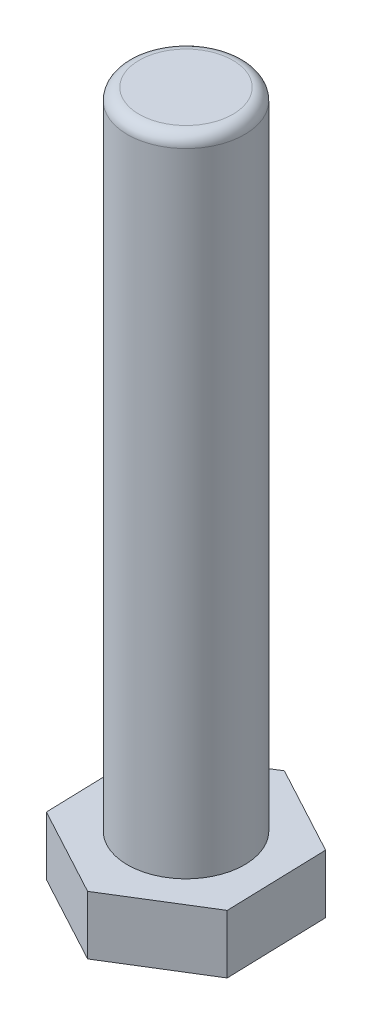
ISO-10303-21;
HEADER;
FILE_DESCRIPTION(('STEP AP214'),'2;1');
FILE_NAME('part.step','',(''),(''),'','','');
FILE_SCHEMA(('AUTOMOTIVE_DESIGN { 1 0 10303 214 1 1 1 1 }'));
ENDSEC;
DATA;
#1=APPLICATION_CONTEXT('core data for automotive mechanical design processes');
#2=APPLICATION_PROTOCOL_DEFINITION('international standard','automotive_design',2000,#1);
#3=PRODUCT_CONTEXT('',#1,'mechanical');
#4=PRODUCT('Part','Part','',(#3));
#5=PRODUCT_RELATED_PRODUCT_CATEGORY('part','',(#4));
#6=PRODUCT_DEFINITION_FORMATION('','',#4);
#7=PRODUCT_DEFINITION_CONTEXT('part definition',#1,'design');
#8=PRODUCT_DEFINITION('design','',#6,#7);
#9=PRODUCT_DEFINITION_SHAPE('','',#8);
#10=(LENGTH_UNIT() NAMED_UNIT(*) SI_UNIT(.MILLI.,.METRE.));
#11=(NAMED_UNIT(*) PLANE_ANGLE_UNIT() SI_UNIT($,.RADIAN.));
#12=(NAMED_UNIT(*) SI_UNIT($,.STERADIAN.) SOLID_ANGLE_UNIT());
#13=UNCERTAINTY_MEASURE_WITH_UNIT(LENGTH_MEASURE(1.E-05),#10,'distance_accuracy_value','');
#14=(GEOMETRIC_REPRESENTATION_CONTEXT(3) GLOBAL_UNCERTAINTY_ASSIGNED_CONTEXT((#13)) GLOBAL_UNIT_ASSIGNED_CONTEXT((#10,
#11,#12)) REPRESENTATION_CONTEXT('',''));
#15=CARTESIAN_POINT('',(0.,0.,0.));
#16=DIRECTION('',(0.,0.,1.));
#17=DIRECTION('',(1.,0.,0.));
#18=AXIS2_PLACEMENT_3D('',#15,#16,#17);
#19=CARTESIAN_POINT('',(-15.2505200028496,10.,-8.21106811825871));
#20=DIRECTION('',(0.99955911956303,0.,-0.0296911855334134));
#21=DIRECTION('',(-0.0296911855334134,0.,-0.999559119563031));
#22=AXIS2_PLACEMENT_3D('',#19,#20,#21);
#23=PLANE('',#22);
#24=DIRECTION('',(0.0296911855334134,0.,0.99955911956303));
#25=VECTOR('',#24,1.);
#26=CARTESIAN_POINT('',(-15.2505200028496,0.,-8.21106811825871));
#27=LINE('',#26,#25);
#28=CARTESIAN_POINT('',(-15.2505200028496,0.,-8.21106811825871));
#29=VERTEX_POINT('',#28);
#30=CARTESIAN_POINT('',(-14.7362535840413,0.,9.10180368426112));
#31=VERTEX_POINT('',#30);
#32=EDGE_CURVE('E123',#29,#31,#27,.T.);
#33=ORIENTED_EDGE('',*,*,#32,.T.);
#34=DIRECTION('',(0.,-1.,0.));
#35=VECTOR('',#34,1.);
#36=CARTESIAN_POINT('',(-14.7362535840413,10.,9.10180368426112));
#37=LINE('',#36,#35);
#38=CARTESIAN_POINT('',(-14.7362535840413,10.,9.10180368426112));
#39=VERTEX_POINT('',#38);
#40=EDGE_CURVE('E140',#39,#31,#37,.T.);
#41=ORIENTED_EDGE('',*,*,#40,.F.);
#42=DIRECTION('',(0.0296911855334134,0.,0.99955911956303));
#43=VECTOR('',#42,1.);
#44=CARTESIAN_POINT('',(-15.2505200028496,10.,-8.21106811825871));
#45=LINE('',#44,#43);
#46=CARTESIAN_POINT('',(-15.2505200028496,10.,-8.21106811825871));
#47=VERTEX_POINT('',#46);
#48=EDGE_CURVE('E133',#47,#39,#45,.T.);
#49=ORIENTED_EDGE('',*,*,#48,.F.);
#50=DIRECTION('',(0.,-1.,0.));
#51=VECTOR('',#50,1.);
#52=CARTESIAN_POINT('',(-15.2505200028496,10.,-8.21106811825871));
#53=LINE('',#52,#51);
#54=EDGE_CURVE('E119',#47,#29,#53,.T.);
#55=ORIENTED_EDGE('',*,*,#54,.T.);
#56=EDGE_LOOP('',(#33,#41,#49,#55));
#57=FACE_BOUND('',#56,.T.);
#58=ADVANCED_FACE('F37',(#57),#23,.F.);
#59=CARTESIAN_POINT('',(-14.7362535840413,10.,9.10180368426112));
#60=DIRECTION('',(0.474066238841102,0.,-0.880489182892698));
#61=DIRECTION('',(-0.880489182892698,0.,-0.474066238841102));
#62=AXIS2_PLACEMENT_3D('',#59,#60,#61);
#63=PLANE('',#62);
#64=DIRECTION('',(0.880489182892698,0.,0.474066238841102));
#65=VECTOR('',#64,1.);
#66=CARTESIAN_POINT('',(-14.7362535840413,0.,9.10180368426112));
#67=LINE('',#66,#65);
#68=CARTESIAN_POINT('',(0.51426641880826,0.,17.3128718025198));
#69=VERTEX_POINT('',#68);
#70=EDGE_CURVE('E126',#31,#69,#67,.T.);
#71=ORIENTED_EDGE('',*,*,#70,.T.);
#72=DIRECTION('',(0.,-1.,0.));
#73=VECTOR('',#72,1.);
#74=CARTESIAN_POINT('',(0.51426641880826,10.,17.3128718025198));
#75=LINE('',#74,#73);
#76=CARTESIAN_POINT('',(0.51426641880826,10.,17.3128718025198));
#77=VERTEX_POINT('',#76);
#78=EDGE_CURVE('E137',#77,#69,#75,.T.);
#79=ORIENTED_EDGE('',*,*,#78,.F.);
#80=DIRECTION('',(0.880489182892698,0.,0.474066238841102));
#81=VECTOR('',#80,1.);
#82=CARTESIAN_POINT('',(-14.7362535840413,10.,9.10180368426112));
#83=LINE('',#82,#81);
#84=EDGE_CURVE('E92',#39,#77,#83,.T.);
#85=ORIENTED_EDGE('',*,*,#84,.F.);
#86=ORIENTED_EDGE('',*,*,#40,.T.);
#87=EDGE_LOOP('',(#71,#79,#85,#86));
#88=FACE_BOUND('',#87,.T.);
#89=ADVANCED_FACE('F153',(#88),#63,.F.);
#90=CARTESIAN_POINT('',(0.51426641880826,10.,17.3128718025198));
#91=DIRECTION('',(-0.525492880721928,0.,-0.850797997359285));
#92=DIRECTION('',(-0.850797997359285,0.,0.525492880721928));
#93=AXIS2_PLACEMENT_3D('',#90,#91,#92);
#94=PLANE('',#93);
#95=DIRECTION('',(0.850797997359284,0.,-0.525492880721928));
#96=VECTOR('',#95,1.);
#97=CARTESIAN_POINT('',(0.51426641880826,0.,17.3128718025198));
#98=LINE('',#97,#96);
#99=CARTESIAN_POINT('',(15.2505200028496,0.,8.21106811825871));
#100=VERTEX_POINT('',#99);
#101=EDGE_CURVE('E128',#69,#100,#98,.T.);
#102=ORIENTED_EDGE('',*,*,#101,.T.);
#103=DIRECTION('',(0.,-1.,0.));
#104=VECTOR('',#103,1.);
#105=CARTESIAN_POINT('',(15.2505200028496,10.,8.21106811825871));
#106=LINE('',#105,#104);
#107=CARTESIAN_POINT('',(15.2505200028496,10.,8.21106811825871));
#108=VERTEX_POINT('',#107);
#109=EDGE_CURVE('E114',#108,#100,#106,.T.);
#110=ORIENTED_EDGE('',*,*,#109,.F.);
#111=DIRECTION('',(0.850797997359284,0.,-0.525492880721928));
#112=VECTOR('',#111,1.);
#113=CARTESIAN_POINT('',(0.51426641880826,10.,17.3128718025198));
#114=LINE('',#113,#112);
#115=EDGE_CURVE('E105',#77,#108,#114,.T.);
#116=ORIENTED_EDGE('',*,*,#115,.F.);
#117=ORIENTED_EDGE('',*,*,#78,.T.);
#118=EDGE_LOOP('',(#102,#110,#116,#117));
#119=FACE_BOUND('',#118,.T.);
#120=ADVANCED_FACE('F156',(#119),#94,.F.);
#121=CARTESIAN_POINT('',(15.2505200028496,10.,8.21106811825871));
#122=DIRECTION('',(-0.99955911956303,0.,0.0296911855334137));
#123=DIRECTION('',(0.0296911855334137,0.,0.999559119563031));
#124=AXIS2_PLACEMENT_3D('',#121,#122,#123);
#125=PLANE('',#124);
#126=DIRECTION('',(-0.0296911855334137,0.,-0.99955911956303));
#127=VECTOR('',#126,1.);
#128=CARTESIAN_POINT('',(15.2505200028496,0.,8.21106811825871));
#129=LINE('',#128,#127);
#130=CARTESIAN_POINT('',(14.7362535840413,0.,-9.10180368426112));
#131=VERTEX_POINT('',#130);
#132=EDGE_CURVE('E113',#100,#131,#129,.T.);
#133=ORIENTED_EDGE('',*,*,#132,.T.);
#134=DIRECTION('',(0.,-1.,0.));
#135=VECTOR('',#134,1.);
#136=CARTESIAN_POINT('',(14.7362535840413,10.,-9.10180368426112));
#137=LINE('',#136,#135);
#138=CARTESIAN_POINT('',(14.7362535840413,10.,-9.10180368426112));
#139=VERTEX_POINT('',#138);
#140=EDGE_CURVE('E110',#139,#131,#137,.T.);
#141=ORIENTED_EDGE('',*,*,#140,.F.);
#142=DIRECTION('',(-0.0296911855334137,0.,-0.99955911956303));
#143=VECTOR('',#142,1.);
#144=CARTESIAN_POINT('',(15.2505200028496,10.,8.21106811825871));
#145=LINE('',#144,#143);
#146=EDGE_CURVE('E99',#108,#139,#145,.T.);
#147=ORIENTED_EDGE('',*,*,#146,.F.);
#148=ORIENTED_EDGE('',*,*,#109,.T.);
#149=EDGE_LOOP('',(#133,#141,#147,#148));
#150=FACE_BOUND('',#149,.T.);
#151=ADVANCED_FACE('F111',(#150),#125,.F.);
#152=CARTESIAN_POINT('',(14.7362535840413,10.,-9.10180368426112));
#153=DIRECTION('',(-0.474066238841102,0.,0.880489182892698));
#154=DIRECTION('',(0.880489182892698,0.,0.474066238841102));
#155=AXIS2_PLACEMENT_3D('',#152,#153,#154);
#156=PLANE('',#155);
#157=DIRECTION('',(-0.880489182892698,0.,-0.474066238841102));
#158=VECTOR('',#157,1.);
#159=CARTESIAN_POINT('',(14.7362535840413,0.,-9.10180368426112));
#160=LINE('',#159,#158);
#161=CARTESIAN_POINT('',(-0.514266418808263,0.,-17.3128718025198));
#162=VERTEX_POINT('',#161);
#163=EDGE_CURVE('E77',#131,#162,#160,.T.);
#164=ORIENTED_EDGE('',*,*,#163,.T.);
#165=DIRECTION('',(0.,-1.,0.));
#166=VECTOR('',#165,1.);
#167=CARTESIAN_POINT('',(-0.514266418808263,10.,-17.3128718025198));
#168=LINE('',#167,#166);
#169=CARTESIAN_POINT('',(-0.514266418808263,10.,-17.3128718025198));
#170=VERTEX_POINT('',#169);
#171=EDGE_CURVE('E115',#170,#162,#168,.T.);
#172=ORIENTED_EDGE('',*,*,#171,.F.);
#173=DIRECTION('',(-0.880489182892698,0.,-0.474066238841102));
#174=VECTOR('',#173,1.);
#175=CARTESIAN_POINT('',(14.7362535840413,10.,-9.10180368426112));
#176=LINE('',#175,#174);
#177=EDGE_CURVE('E103',#139,#170,#176,.T.);
#178=ORIENTED_EDGE('',*,*,#177,.F.);
#179=ORIENTED_EDGE('',*,*,#140,.T.);
#180=EDGE_LOOP('',(#164,#172,#178,#179));
#181=FACE_BOUND('',#180,.T.);
#182=ADVANCED_FACE('F117',(#181),#156,.F.);
#183=CARTESIAN_POINT('',(-0.514266418808263,10.,-17.3128718025198));
#184=DIRECTION('',(0.525492880721928,0.,0.850797997359285));
#185=DIRECTION('',(0.850797997359285,0.,-0.525492880721928));
#186=AXIS2_PLACEMENT_3D('',#183,#184,#185);
#187=PLANE('',#186);
#188=DIRECTION('',(-0.850797997359285,0.,0.525492880721928));
#189=VECTOR('',#188,1.);
#190=CARTESIAN_POINT('',(-0.514266418808263,0.,-17.3128718025198));
#191=LINE('',#190,#189);
#192=EDGE_CURVE('E83',#162,#29,#191,.T.);
#193=ORIENTED_EDGE('',*,*,#192,.T.);
#194=ORIENTED_EDGE('',*,*,#54,.F.);
#195=DIRECTION('',(-0.850797997359285,0.,0.525492880721928));
#196=VECTOR('',#195,1.);
#197=CARTESIAN_POINT('',(-0.514266418808263,10.,-17.3128718025198));
#198=LINE('',#197,#196);
#199=EDGE_CURVE('E54',#170,#47,#198,.T.);
#200=ORIENTED_EDGE('',*,*,#199,.F.);
#201=ORIENTED_EDGE('',*,*,#171,.T.);
#202=EDGE_LOOP('',(#193,#194,#200,#201));
#203=FACE_BOUND('',#202,.T.);
#204=ADVANCED_FACE('F161',(#203),#187,.F.);
#205=CARTESIAN_POINT('',(0.,10.,0.));
#206=DIRECTION('',(0.,1.,0.));
#207=DIRECTION('',(0.,0.,1.));
#208=AXIS2_PLACEMENT_3D('',#205,#206,#207);
#209=PLANE('',#208);
#210=CARTESIAN_POINT('',(0.,10.,0.));
#211=DIRECTION('',(0.,1.,0.));
#212=DIRECTION('',(0.,0.,1.));
#213=AXIS2_PLACEMENT_3D('',#210,#211,#212);
#214=CIRCLE('',#213,10.);
#215=CARTESIAN_POINT('',(0.,10.,10.));
#216=VERTEX_POINT('',#215);
#217=EDGE_CURVE('E141',#216,#216,#214,.T.);
#218=ORIENTED_EDGE('',*,*,#217,.F.);
#219=EDGE_LOOP('',(#218));
#220=FACE_BOUND('',#219,.T.);
#221=ORIENTED_EDGE('',*,*,#48,.T.);
#222=ORIENTED_EDGE('',*,*,#84,.T.);
#223=ORIENTED_EDGE('',*,*,#115,.T.);
#224=ORIENTED_EDGE('',*,*,#146,.T.);
#225=ORIENTED_EDGE('',*,*,#177,.T.);
#226=ORIENTED_EDGE('',*,*,#199,.T.);
#227=EDGE_LOOP('',(#221,#222,#223,#224,#225,#226));
#228=FACE_BOUND('',#227,.T.);
#229=ADVANCED_FACE('F101',(#220,#228),#209,.T.);
#230=CARTESIAN_POINT('',(0.,0.,0.));
#231=DIRECTION('',(0.,1.,0.));
#232=DIRECTION('',(0.,0.,1.));
#233=AXIS2_PLACEMENT_3D('',#230,#231,#232);
#234=PLANE('',#233);
#235=ORIENTED_EDGE('',*,*,#32,.F.);
#236=ORIENTED_EDGE('',*,*,#192,.F.);
#237=ORIENTED_EDGE('',*,*,#163,.F.);
#238=ORIENTED_EDGE('',*,*,#132,.F.);
#239=ORIENTED_EDGE('',*,*,#101,.F.);
#240=ORIENTED_EDGE('',*,*,#70,.F.);
#241=EDGE_LOOP('',(#235,#236,#237,#238,#239,#240));
#242=FACE_BOUND('',#241,.T.);
#243=ADVANCED_FACE('F159',(#242),#234,.F.);
#244=CARTESIAN_POINT('',(0.,120.,0.));
#245=DIRECTION('',(0.,-1.,0.));
#246=DIRECTION('',(0.,0.,-1.));
#247=AXIS2_PLACEMENT_3D('',#244,#245,#246);
#248=CYLINDRICAL_SURFACE('',#247,10.);
#249=CARTESIAN_POINT('',(0.,118.,0.));
#250=DIRECTION('',(0.,1.,0.));
#251=DIRECTION('',(0.,0.,1.));
#252=AXIS2_PLACEMENT_3D('',#249,#250,#251);
#253=CIRCLE('',#252,10.);
#254=CARTESIAN_POINT('',(0.,118.,10.));
#255=VERTEX_POINT('',#254);
#256=EDGE_CURVE('E11',#255,#255,#253,.F.);
#257=ORIENTED_EDGE('',*,*,#256,.T.);
#258=EDGE_LOOP('',(#257));
#259=FACE_BOUND('',#258,.T.);
#260=ORIENTED_EDGE('',*,*,#217,.T.);
#261=EDGE_LOOP('',(#260));
#262=FACE_BOUND('',#261,.T.);
#263=ADVANCED_FACE('F203',(#259,#262),#248,.T.);
#264=CARTESIAN_POINT('',(0.,120.,0.));
#265=DIRECTION('',(0.,1.,0.));
#266=DIRECTION('',(0.,0.,1.));
#267=AXIS2_PLACEMENT_3D('',#264,#265,#266);
#268=PLANE('',#267);
#269=CARTESIAN_POINT('',(0.,120.,0.));
#270=DIRECTION('',(0.,1.,0.));
#271=DIRECTION('',(0.,0.,1.));
#272=AXIS2_PLACEMENT_3D('',#269,#270,#271);
#273=CIRCLE('',#272,8.);
#274=CARTESIAN_POINT('',(0.,120.,8.));
#275=VERTEX_POINT('',#274);
#276=EDGE_CURVE('E46',#275,#275,#273,.T.);
#277=ORIENTED_EDGE('',*,*,#276,.T.);
#278=EDGE_LOOP('',(#277));
#279=FACE_BOUND('',#278,.T.);
#280=ADVANCED_FACE('F217',(#279),#268,.T.);
#281=CARTESIAN_POINT('',(0.,118.,0.));
#282=DIRECTION('',(0.,1.,0.));
#283=DIRECTION('',(0.,0.,1.));
#284=AXIS2_PLACEMENT_3D('',#281,#282,#283);
#285=TOROIDAL_SURFACE('',#284,8.,2.);
#286=ORIENTED_EDGE('',*,*,#256,.F.);
#287=EDGE_LOOP('',(#286));
#288=FACE_BOUND('',#287,.T.);
#289=ORIENTED_EDGE('',*,*,#276,.F.);
#290=EDGE_LOOP('',(#289));
#291=FACE_BOUND('',#290,.T.);
#292=ADVANCED_FACE('F39',(#288,#291),#285,.T.);
#293=CLOSED_SHELL('',(#58,#89,#120,#151,#182,#204,#229,#243,#263,#280,#292));
#294=MANIFOLD_SOLID_BREP('B2',#293);
#295=ADVANCED_BREP_SHAPE_REPRESENTATION('',(#18,#294),#14);
#296=SHAPE_DEFINITION_REPRESENTATION(#9,#295);
ENDSEC;
END-ISO-10303-21;
